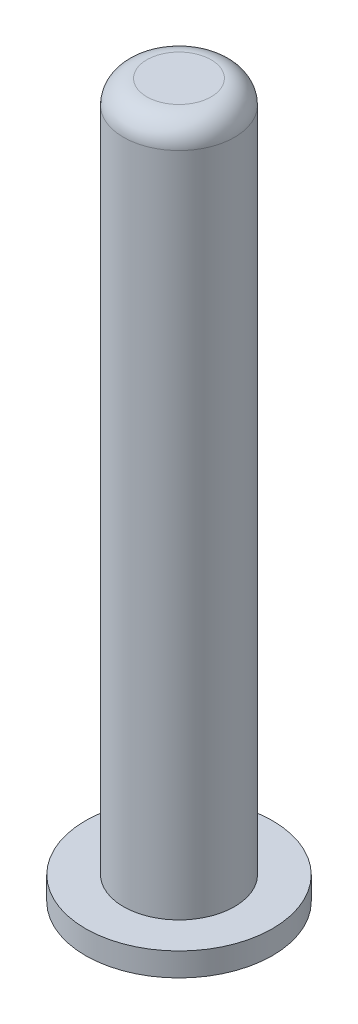
ISO-10303-21;
HEADER;
FILE_DESCRIPTION(('STEP AP214'),'2;1');
FILE_NAME('part.step','',(''),(''),'','','');
FILE_SCHEMA(('AUTOMOTIVE_DESIGN { 1 0 10303 214 1 1 1 1 }'));
ENDSEC;
DATA;
#1=APPLICATION_CONTEXT('core data for automotive mechanical design processes');
#2=APPLICATION_PROTOCOL_DEFINITION('international standard','automotive_design',2000,#1);
#3=PRODUCT_CONTEXT('',#1,'mechanical');
#4=PRODUCT('Part','Part','',(#3));
#5=PRODUCT_RELATED_PRODUCT_CATEGORY('part','',(#4));
#6=PRODUCT_DEFINITION_FORMATION('','',#4);
#7=PRODUCT_DEFINITION_CONTEXT('part definition',#1,'design');
#8=PRODUCT_DEFINITION('design','',#6,#7);
#9=PRODUCT_DEFINITION_SHAPE('','',#8);
#10=(LENGTH_UNIT() NAMED_UNIT(*) SI_UNIT(.MILLI.,.METRE.));
#11=(NAMED_UNIT(*) PLANE_ANGLE_UNIT() SI_UNIT($,.RADIAN.));
#12=(NAMED_UNIT(*) SI_UNIT($,.STERADIAN.) SOLID_ANGLE_UNIT());
#13=UNCERTAINTY_MEASURE_WITH_UNIT(LENGTH_MEASURE(1.E-05),#10,'distance_accuracy_value','');
#14=(GEOMETRIC_REPRESENTATION_CONTEXT(3) GLOBAL_UNCERTAINTY_ASSIGNED_CONTEXT((#13)) GLOBAL_UNIT_ASSIGNED_CONTEXT((#10,
#11,#12)) REPRESENTATION_CONTEXT('',''));
#15=CARTESIAN_POINT('',(0.,0.,0.));
#16=DIRECTION('',(0.,0.,1.));
#17=DIRECTION('',(1.,0.,0.));
#18=AXIS2_PLACEMENT_3D('',#15,#16,#17);
#19=CARTESIAN_POINT('',(0.,57.,0.));
#20=DIRECTION('',(0.,1.,0.));
#21=DIRECTION('',(0.,0.,1.));
#22=AXIS2_PLACEMENT_3D('',#19,#20,#21);
#23=TOROIDAL_SURFACE('',#22,2.75,2.);
#24=CARTESIAN_POINT('',(0.,59.,0.));
#25=DIRECTION('',(0.,1.,0.));
#26=DIRECTION('',(0.,0.,1.));
#27=AXIS2_PLACEMENT_3D('',#24,#25,#26);
#28=CIRCLE('',#27,2.75);
#29=CARTESIAN_POINT('',(0.,59.,2.75));
#30=VERTEX_POINT('',#29);
#31=EDGE_CURVE('E37',#30,#30,#28,.T.);
#32=ORIENTED_EDGE('',*,*,#31,.F.);
#33=EDGE_LOOP('',(#32));
#34=FACE_BOUND('',#33,.T.);
#35=CARTESIAN_POINT('',(0.,57.,0.));
#36=DIRECTION('',(0.,1.,0.));
#37=DIRECTION('',(0.,0.,1.));
#38=AXIS2_PLACEMENT_3D('',#35,#36,#37);
#39=CIRCLE('',#38,4.75);
#40=CARTESIAN_POINT('',(0.,57.,4.75));
#41=VERTEX_POINT('',#40);
#42=EDGE_CURVE('E10',#41,#41,#39,.F.);
#43=ORIENTED_EDGE('',*,*,#42,.F.);
#44=EDGE_LOOP('',(#43));
#45=FACE_BOUND('',#44,.T.);
#46=ADVANCED_FACE('F31',(#34,#45),#23,.T.);
#47=CARTESIAN_POINT('',(0.,59.,0.));
#48=DIRECTION('',(0.,-1.,0.));
#49=DIRECTION('',(0.,0.,-1.));
#50=AXIS2_PLACEMENT_3D('',#47,#48,#49);
#51=CYLINDRICAL_SURFACE('',#50,4.75);
#52=ORIENTED_EDGE('',*,*,#42,.T.);
#53=EDGE_LOOP('',(#52));
#54=FACE_BOUND('',#53,.T.);
#55=CARTESIAN_POINT('',(0.,0.,0.));
#56=DIRECTION('',(0.,1.,0.));
#57=DIRECTION('',(0.,0.,1.));
#58=AXIS2_PLACEMENT_3D('',#55,#56,#57);
#59=CIRCLE('',#58,4.75);
#60=CARTESIAN_POINT('',(0.,0.,4.75));
#61=VERTEX_POINT('',#60);
#62=EDGE_CURVE('E41',#61,#61,#59,.T.);
#63=ORIENTED_EDGE('',*,*,#62,.T.);
#64=EDGE_LOOP('',(#63));
#65=FACE_BOUND('',#64,.T.);
#66=ADVANCED_FACE('F73',(#54,#65),#51,.T.);
#67=CARTESIAN_POINT('',(0.,59.,0.));
#68=DIRECTION('',(0.,1.,0.));
#69=DIRECTION('',(0.,0.,1.));
#70=AXIS2_PLACEMENT_3D('',#67,#68,#69);
#71=PLANE('',#70);
#72=ORIENTED_EDGE('',*,*,#31,.T.);
#73=EDGE_LOOP('',(#72));
#74=FACE_BOUND('',#73,.T.);
#75=ADVANCED_FACE('F59',(#74),#71,.T.);
#76=CARTESIAN_POINT('',(0.,-2.,0.));
#77=DIRECTION('',(0.,1.,0.));
#78=DIRECTION('',(0.,0.,1.));
#79=AXIS2_PLACEMENT_3D('',#76,#77,#78);
#80=CYLINDRICAL_SURFACE('',#79,8.);
#81=CARTESIAN_POINT('',(0.,-2.,0.));
#82=DIRECTION('',(0.,-1.,0.));
#83=DIRECTION('',(0.,0.,-1.));
#84=AXIS2_PLACEMENT_3D('',#81,#82,#83);
#85=CIRCLE('',#84,8.);
#86=CARTESIAN_POINT('',(0.,-2.,-8.));
#87=VERTEX_POINT('',#86);
#88=EDGE_CURVE('E45',#87,#87,#85,.T.);
#89=ORIENTED_EDGE('',*,*,#88,.F.);
#90=EDGE_LOOP('',(#89));
#91=FACE_BOUND('',#90,.T.);
#92=CARTESIAN_POINT('',(0.,0.,0.));
#93=DIRECTION('',(0.,-1.,0.));
#94=DIRECTION('',(0.,0.,-1.));
#95=AXIS2_PLACEMENT_3D('',#92,#93,#94);
#96=CIRCLE('',#95,8.);
#97=CARTESIAN_POINT('',(0.,0.,-8.));
#98=VERTEX_POINT('',#97);
#99=EDGE_CURVE('E48',#98,#98,#96,.T.);
#100=ORIENTED_EDGE('',*,*,#99,.T.);
#101=EDGE_LOOP('',(#100));
#102=FACE_BOUND('',#101,.T.);
#103=ADVANCED_FACE('F56',(#91,#102),#80,.T.);
#104=CARTESIAN_POINT('',(0.,-2.,0.));
#105=DIRECTION('',(0.,-1.,0.));
#106=DIRECTION('',(0.,0.,-1.));
#107=AXIS2_PLACEMENT_3D('',#104,#105,#106);
#108=PLANE('',#107);
#109=ORIENTED_EDGE('',*,*,#88,.T.);
#110=EDGE_LOOP('',(#109));
#111=FACE_BOUND('',#110,.T.);
#112=ADVANCED_FACE('F54',(#111),#108,.T.);
#113=CARTESIAN_POINT('',(0.,0.,0.));
#114=DIRECTION('',(0.,-1.,0.));
#115=DIRECTION('',(0.,0.,-1.));
#116=AXIS2_PLACEMENT_3D('',#113,#114,#115);
#117=PLANE('',#116);
#118=ORIENTED_EDGE('',*,*,#62,.F.);
#119=EDGE_LOOP('',(#118));
#120=FACE_BOUND('',#119,.T.);
#121=ORIENTED_EDGE('',*,*,#99,.F.);
#122=EDGE_LOOP('',(#121));
#123=FACE_BOUND('',#122,.T.);
#124=ADVANCED_FACE('F63',(#120,#123),#117,.F.);
#125=CLOSED_SHELL('',(#46,#66,#75,#103,#112,#124));
#126=MANIFOLD_SOLID_BREP('B2',#125);
#127=ADVANCED_BREP_SHAPE_REPRESENTATION('',(#18,#126),#14);
#128=SHAPE_DEFINITION_REPRESENTATION(#9,#127);
ENDSEC;
END-ISO-10303-21;
